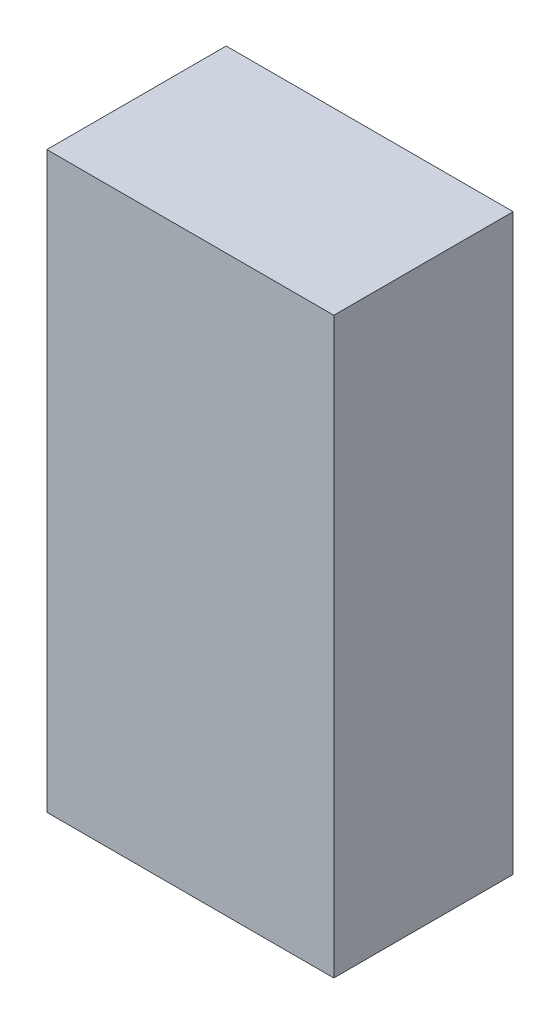
ISO-10303-21;
HEADER;
FILE_DESCRIPTION(('STEP AP214'),'2;1');
FILE_NAME('part.step','',(''),(''),'','','');
FILE_SCHEMA(('AUTOMOTIVE_DESIGN { 1 0 10303 214 1 1 1 1 }'));
ENDSEC;
DATA;
#1=APPLICATION_CONTEXT('core data for automotive mechanical design processes');
#2=APPLICATION_PROTOCOL_DEFINITION('international standard','automotive_design',2000,#1);
#3=PRODUCT_CONTEXT('',#1,'mechanical');
#4=PRODUCT('Part','Part','',(#3));
#5=PRODUCT_RELATED_PRODUCT_CATEGORY('part','',(#4));
#6=PRODUCT_DEFINITION_FORMATION('','',#4);
#7=PRODUCT_DEFINITION_CONTEXT('part definition',#1,'design');
#8=PRODUCT_DEFINITION('design','',#6,#7);
#9=PRODUCT_DEFINITION_SHAPE('','',#8);
#10=(LENGTH_UNIT() NAMED_UNIT(*) SI_UNIT(.MILLI.,.METRE.));
#11=(NAMED_UNIT(*) PLANE_ANGLE_UNIT() SI_UNIT($,.RADIAN.));
#12=(NAMED_UNIT(*) SI_UNIT($,.STERADIAN.) SOLID_ANGLE_UNIT());
#13=UNCERTAINTY_MEASURE_WITH_UNIT(LENGTH_MEASURE(1.E-05),#10,'distance_accuracy_value','');
#14=(GEOMETRIC_REPRESENTATION_CONTEXT(3) GLOBAL_UNCERTAINTY_ASSIGNED_CONTEXT((#13)) GLOBAL_UNIT_ASSIGNED_CONTEXT((#10,
#11,#12)) REPRESENTATION_CONTEXT('',''));
#15=CARTESIAN_POINT('',(0.,0.,0.));
#16=DIRECTION('',(0.,0.,1.));
#17=DIRECTION('',(1.,0.,0.));
#18=AXIS2_PLACEMENT_3D('',#15,#16,#17);
#19=CARTESIAN_POINT('',(0.80000094,1.59999934,1.00000054));
#20=DIRECTION('',(0.,0.,1.));
#21=DIRECTION('',(1.,0.,0.));
#22=AXIS2_PLACEMENT_3D('',#19,#20,#21);
#23=PLANE('',#22);
#24=DIRECTION('',(1.,0.,0.));
#25=VECTOR('',#24,1.);
#26=CARTESIAN_POINT('',(0.80000094,-1.59999934,1.00000054));
#27=LINE('',#26,#25);
#28=CARTESIAN_POINT('',(0.80000094,-1.59999934,1.00000054));
#29=VERTEX_POINT('',#28);
#30=CARTESIAN_POINT('',(-0.80000094,-1.59999934,1.00000054));
#31=VERTEX_POINT('',#30);
#32=EDGE_CURVE('E53',#29,#31,#27,.F.);
#33=ORIENTED_EDGE('',*,*,#32,.F.);
#34=DIRECTION('',(0.,1.,0.));
#35=VECTOR('',#34,1.);
#36=CARTESIAN_POINT('',(0.80000094,1.59999934,1.00000054));
#37=LINE('',#36,#35);
#38=CARTESIAN_POINT('',(0.80000094,1.59999934,1.00000054));
#39=VERTEX_POINT('',#38);
#40=EDGE_CURVE('E68',#39,#29,#37,.F.);
#41=ORIENTED_EDGE('',*,*,#40,.F.);
#42=DIRECTION('',(1.,0.,0.));
#43=VECTOR('',#42,1.);
#44=CARTESIAN_POINT('',(-0.80000094,1.59999934,1.00000054));
#45=LINE('',#44,#43);
#46=CARTESIAN_POINT('',(-0.80000094,1.59999934,1.00000054));
#47=VERTEX_POINT('',#46);
#48=EDGE_CURVE('E20',#47,#39,#45,.T.);
#49=ORIENTED_EDGE('',*,*,#48,.F.);
#50=DIRECTION('',(0.,1.,0.));
#51=VECTOR('',#50,1.);
#52=CARTESIAN_POINT('',(-0.80000094,-1.59999934,1.00000054));
#53=LINE('',#52,#51);
#54=EDGE_CURVE('E58',#31,#47,#53,.T.);
#55=ORIENTED_EDGE('',*,*,#54,.F.);
#56=EDGE_LOOP('',(#33,#41,#49,#55));
#57=FACE_BOUND('',#56,.T.);
#58=ADVANCED_FACE('F17',(#57),#23,.T.);
#59=CARTESIAN_POINT('',(-0.80000094,1.59999934,0.));
#60=DIRECTION('',(0.,1.,0.));
#61=DIRECTION('',(0.,0.,1.));
#62=AXIS2_PLACEMENT_3D('',#59,#60,#61);
#63=PLANE('',#62);
#64=DIRECTION('',(0.,0.,-1.));
#65=VECTOR('',#64,1.);
#66=CARTESIAN_POINT('',(0.80000094,1.59999934,0.));
#67=LINE('',#66,#65);
#68=CARTESIAN_POINT('',(0.80000094,1.59999934,0.));
#69=VERTEX_POINT('',#68);
#70=EDGE_CURVE('E79',#69,#39,#67,.F.);
#71=ORIENTED_EDGE('',*,*,#70,.F.);
#72=DIRECTION('',(1.,0.,0.));
#73=VECTOR('',#72,1.);
#74=CARTESIAN_POINT('',(0.80000094,1.59999934,0.));
#75=LINE('',#74,#73);
#76=CARTESIAN_POINT('',(-0.80000094,1.59999934,0.));
#77=VERTEX_POINT('',#76);
#78=EDGE_CURVE('E74',#69,#77,#75,.F.);
#79=ORIENTED_EDGE('',*,*,#78,.T.);
#80=DIRECTION('',(0.,0.,1.));
#81=VECTOR('',#80,1.);
#82=CARTESIAN_POINT('',(-0.80000094,1.59999934,0.));
#83=LINE('',#82,#81);
#84=EDGE_CURVE('E63',#47,#77,#83,.F.);
#85=ORIENTED_EDGE('',*,*,#84,.F.);
#86=ORIENTED_EDGE('',*,*,#48,.T.);
#87=EDGE_LOOP('',(#71,#79,#85,#86));
#88=FACE_BOUND('',#87,.T.);
#89=ADVANCED_FACE('F73',(#88),#63,.T.);
#90=CARTESIAN_POINT('',(-0.80000094,-1.59999934,0.));
#91=DIRECTION('',(-1.,0.,0.));
#92=DIRECTION('',(0.,0.,1.));
#93=AXIS2_PLACEMENT_3D('',#90,#91,#92);
#94=PLANE('',#93);
#95=ORIENTED_EDGE('',*,*,#84,.T.);
#96=DIRECTION('',(0.,1.,0.));
#97=VECTOR('',#96,1.);
#98=CARTESIAN_POINT('',(-0.80000094,1.59999934,0.));
#99=LINE('',#98,#97);
#100=CARTESIAN_POINT('',(-0.80000094,-1.59999934,0.));
#101=VERTEX_POINT('',#100);
#102=EDGE_CURVE('E84',#77,#101,#99,.F.);
#103=ORIENTED_EDGE('',*,*,#102,.T.);
#104=DIRECTION('',(0.,0.,-1.));
#105=VECTOR('',#104,1.);
#106=CARTESIAN_POINT('',(-0.80000094,-1.59999934,0.));
#107=LINE('',#106,#105);
#108=EDGE_CURVE('E65',#31,#101,#107,.T.);
#109=ORIENTED_EDGE('',*,*,#108,.F.);
#110=ORIENTED_EDGE('',*,*,#54,.T.);
#111=EDGE_LOOP('',(#95,#103,#109,#110));
#112=FACE_BOUND('',#111,.T.);
#113=ADVANCED_FACE('F60',(#112),#94,.T.);
#114=CARTESIAN_POINT('',(0.80000094,-1.59999934,0.));
#115=DIRECTION('',(0.,-1.,0.));
#116=DIRECTION('',(0.,0.,-1.));
#117=AXIS2_PLACEMENT_3D('',#114,#115,#116);
#118=PLANE('',#117);
#119=ORIENTED_EDGE('',*,*,#108,.T.);
#120=DIRECTION('',(1.,0.,0.));
#121=VECTOR('',#120,1.);
#122=CARTESIAN_POINT('',(0.80000094,-1.59999934,0.));
#123=LINE('',#122,#121);
#124=CARTESIAN_POINT('',(0.80000094,-1.59999934,0.));
#125=VERTEX_POINT('',#124);
#126=EDGE_CURVE('E26',#101,#125,#123,.T.);
#127=ORIENTED_EDGE('',*,*,#126,.T.);
#128=DIRECTION('',(0.,0.,-1.));
#129=VECTOR('',#128,1.);
#130=CARTESIAN_POINT('',(0.80000094,-1.59999934,0.));
#131=LINE('',#130,#129);
#132=EDGE_CURVE('E34',#29,#125,#131,.T.);
#133=ORIENTED_EDGE('',*,*,#132,.F.);
#134=ORIENTED_EDGE('',*,*,#32,.T.);
#135=EDGE_LOOP('',(#119,#127,#133,#134));
#136=FACE_BOUND('',#135,.T.);
#137=ADVANCED_FACE('F88',(#136),#118,.T.);
#138=CARTESIAN_POINT('',(0.80000094,1.59999934,0.));
#139=DIRECTION('',(1.,0.,0.));
#140=DIRECTION('',(0.,0.,-1.));
#141=AXIS2_PLACEMENT_3D('',#138,#139,#140);
#142=PLANE('',#141);
#143=ORIENTED_EDGE('',*,*,#132,.T.);
#144=DIRECTION('',(0.,1.,0.));
#145=VECTOR('',#144,1.);
#146=CARTESIAN_POINT('',(0.80000094,1.59999934,0.));
#147=LINE('',#146,#145);
#148=EDGE_CURVE('E11',#125,#69,#147,.T.);
#149=ORIENTED_EDGE('',*,*,#148,.T.);
#150=ORIENTED_EDGE('',*,*,#70,.T.);
#151=ORIENTED_EDGE('',*,*,#40,.T.);
#152=EDGE_LOOP('',(#143,#149,#150,#151));
#153=FACE_BOUND('',#152,.T.);
#154=ADVANCED_FACE('F91',(#153),#142,.T.);
#155=CARTESIAN_POINT('',(0.80000094,1.59999934,0.));
#156=DIRECTION('',(0.,0.,1.));
#157=DIRECTION('',(1.,0.,0.));
#158=AXIS2_PLACEMENT_3D('',#155,#156,#157);
#159=PLANE('',#158);
#160=ORIENTED_EDGE('',*,*,#126,.F.);
#161=ORIENTED_EDGE('',*,*,#102,.F.);
#162=ORIENTED_EDGE('',*,*,#78,.F.);
#163=ORIENTED_EDGE('',*,*,#148,.F.);
#164=EDGE_LOOP('',(#160,#161,#162,#163));
#165=FACE_BOUND('',#164,.T.);
#166=ADVANCED_FACE('F90',(#165),#159,.F.);
#167=CLOSED_SHELL('',(#58,#89,#113,#137,#154,#166));
#168=MANIFOLD_SOLID_BREP('B1',#167);
#169=ADVANCED_BREP_SHAPE_REPRESENTATION('',(#18,#168),#14);
#170=SHAPE_DEFINITION_REPRESENTATION(#9,#169);
ENDSEC;
END-ISO-10303-21;
